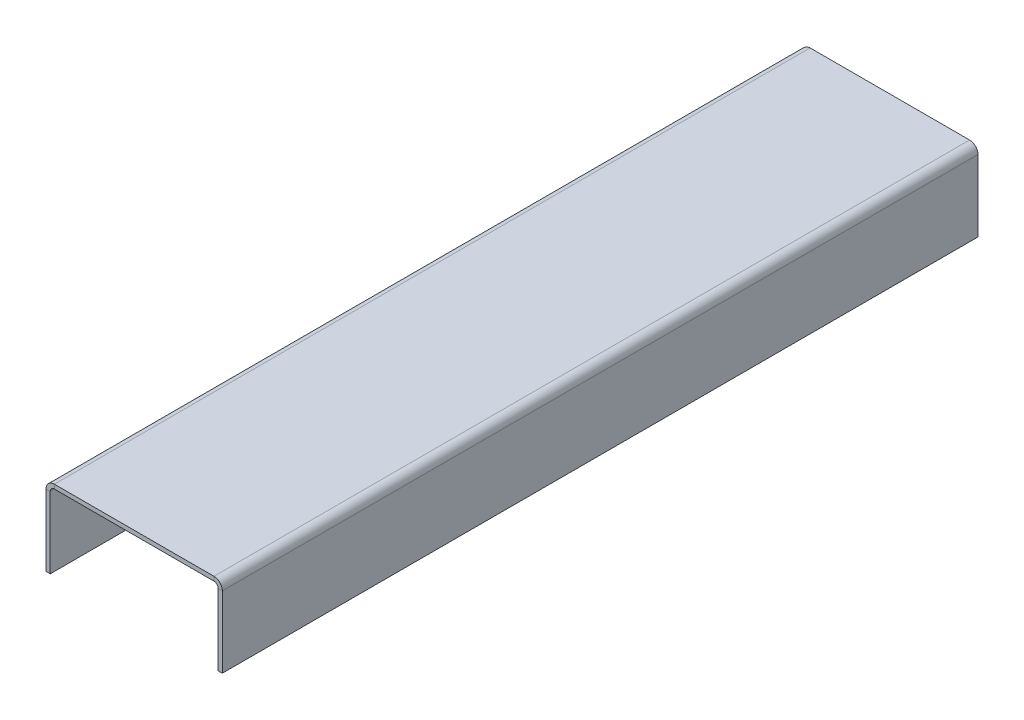
ISO-10303-21;
HEADER;
FILE_DESCRIPTION(('STEP AP214'),'2;1');
FILE_NAME('part.step','',(''),(''),'','','');
FILE_SCHEMA(('AUTOMOTIVE_DESIGN { 1 0 10303 214 1 1 1 1 }'));
ENDSEC;
DATA;
#1=APPLICATION_CONTEXT('core data for automotive mechanical design processes');
#2=APPLICATION_PROTOCOL_DEFINITION('international standard','automotive_design',2000,#1);
#3=PRODUCT_CONTEXT('',#1,'mechanical');
#4=PRODUCT('Part','Part','',(#3));
#5=PRODUCT_RELATED_PRODUCT_CATEGORY('part','',(#4));
#6=PRODUCT_DEFINITION_FORMATION('','',#4);
#7=PRODUCT_DEFINITION_CONTEXT('part definition',#1,'design');
#8=PRODUCT_DEFINITION('design','',#6,#7);
#9=PRODUCT_DEFINITION_SHAPE('','',#8);
#10=(LENGTH_UNIT() NAMED_UNIT(*) SI_UNIT(.MILLI.,.METRE.));
#11=(NAMED_UNIT(*) PLANE_ANGLE_UNIT() SI_UNIT($,.RADIAN.));
#12=(NAMED_UNIT(*) SI_UNIT($,.STERADIAN.) SOLID_ANGLE_UNIT());
#13=UNCERTAINTY_MEASURE_WITH_UNIT(LENGTH_MEASURE(1.E-05),#10,'distance_accuracy_value','');
#14=(GEOMETRIC_REPRESENTATION_CONTEXT(3) GLOBAL_UNCERTAINTY_ASSIGNED_CONTEXT((#13)) GLOBAL_UNIT_ASSIGNED_CONTEXT((#10,
#11,#12)) REPRESENTATION_CONTEXT('',''));
#15=CARTESIAN_POINT('',(0.,0.,0.));
#16=DIRECTION('',(0.,0.,1.));
#17=DIRECTION('',(1.,0.,0.));
#18=AXIS2_PLACEMENT_3D('',#15,#16,#17);
#19=CARTESIAN_POINT('',(-40.,242.,-180.));
#20=DIRECTION('',(0.,0.,1.));
#21=DIRECTION('',(1.,0.,0.));
#22=AXIS2_PLACEMENT_3D('',#19,#20,#21);
#23=PLANE('',#22);
#24=DIRECTION('',(0.,1.,0.));
#25=VECTOR('',#24,1.);
#26=CARTESIAN_POINT('',(-38.,240.,-180.));
#27=LINE('',#26,#25);
#28=CARTESIAN_POINT('',(-38.,240.,-180.));
#29=VERTEX_POINT('',#28);
#30=CARTESIAN_POINT('',(-38.,242.,-180.));
#31=VERTEX_POINT('',#30);
#32=EDGE_CURVE('E203',#29,#31,#27,.T.);
#33=ORIENTED_EDGE('',*,*,#32,.T.);
#34=DIRECTION('',(-1.,0.,0.));
#35=VECTOR('',#34,1.);
#36=CARTESIAN_POINT('',(-40.,242.,-180.));
#37=LINE('',#36,#35);
#38=CARTESIAN_POINT('',(38.,242.,-180.));
#39=VERTEX_POINT('',#38);
#40=EDGE_CURVE('E58',#39,#31,#37,.T.);
#41=ORIENTED_EDGE('',*,*,#40,.F.);
#42=DIRECTION('',(0.,1.,0.));
#43=VECTOR('',#42,1.);
#44=CARTESIAN_POINT('',(38.,240.,-180.));
#45=LINE('',#44,#43);
#46=CARTESIAN_POINT('',(38.,240.,-180.));
#47=VERTEX_POINT('',#46);
#48=EDGE_CURVE('E282',#47,#39,#45,.T.);
#49=ORIENTED_EDGE('',*,*,#48,.F.);
#50=DIRECTION('',(-1.,0.,0.));
#51=VECTOR('',#50,1.);
#52=CARTESIAN_POINT('',(-40.,240.,-180.));
#53=LINE('',#52,#51);
#54=EDGE_CURVE('E285',#47,#29,#53,.T.);
#55=ORIENTED_EDGE('',*,*,#54,.T.);
#56=EDGE_LOOP('',(#33,#41,#49,#55));
#57=FACE_BOUND('',#56,.T.);
#58=ADVANCED_FACE('F49',(#57),#23,.F.);
#59=CARTESIAN_POINT('',(-40.,242.,180.));
#60=DIRECTION('',(0.,0.,-1.));
#61=DIRECTION('',(-1.,0.,0.));
#62=AXIS2_PLACEMENT_3D('',#59,#60,#61);
#63=PLANE('',#62);
#64=DIRECTION('',(0.,1.,0.));
#65=VECTOR('',#64,1.);
#66=CARTESIAN_POINT('',(-38.,240.,180.));
#67=LINE('',#66,#65);
#68=CARTESIAN_POINT('',(-38.,240.,180.));
#69=VERTEX_POINT('',#68);
#70=CARTESIAN_POINT('',(-38.,242.,180.));
#71=VERTEX_POINT('',#70);
#72=EDGE_CURVE('E213',#69,#71,#67,.T.);
#73=ORIENTED_EDGE('',*,*,#72,.F.);
#74=DIRECTION('',(1.,0.,0.));
#75=VECTOR('',#74,1.);
#76=CARTESIAN_POINT('',(-40.,240.,180.));
#77=LINE('',#76,#75);
#78=CARTESIAN_POINT('',(38.,240.,180.));
#79=VERTEX_POINT('',#78);
#80=EDGE_CURVE('E52',#69,#79,#77,.T.);
#81=ORIENTED_EDGE('',*,*,#80,.T.);
#82=DIRECTION('',(0.,1.,0.));
#83=VECTOR('',#82,1.);
#84=CARTESIAN_POINT('',(38.,240.,180.));
#85=LINE('',#84,#83);
#86=CARTESIAN_POINT('',(38.,242.,180.));
#87=VERTEX_POINT('',#86);
#88=EDGE_CURVE('E268',#79,#87,#85,.T.);
#89=ORIENTED_EDGE('',*,*,#88,.T.);
#90=DIRECTION('',(1.,0.,0.));
#91=VECTOR('',#90,1.);
#92=CARTESIAN_POINT('',(-40.,242.,180.));
#93=LINE('',#92,#91);
#94=EDGE_CURVE('E11',#71,#87,#93,.T.);
#95=ORIENTED_EDGE('',*,*,#94,.F.);
#96=EDGE_LOOP('',(#73,#81,#89,#95));
#97=FACE_BOUND('',#96,.T.);
#98=ADVANCED_FACE('F302',(#97),#63,.F.);
#99=CARTESIAN_POINT('',(0.,242.,0.));
#100=DIRECTION('',(0.,1.,0.));
#101=DIRECTION('',(0.,0.,1.));
#102=AXIS2_PLACEMENT_3D('',#99,#100,#101);
#103=PLANE('',#102);
#104=ORIENTED_EDGE('',*,*,#40,.T.);
#105=DIRECTION('',(0.,0.,-1.));
#106=VECTOR('',#105,1.);
#107=CARTESIAN_POINT('',(-38.,242.,-180.));
#108=LINE('',#107,#106);
#109=EDGE_CURVE('E144',#31,#71,#108,.F.);
#110=ORIENTED_EDGE('',*,*,#109,.T.);
#111=ORIENTED_EDGE('',*,*,#94,.T.);
#112=DIRECTION('',(0.,0.,1.));
#113=VECTOR('',#112,1.);
#114=CARTESIAN_POINT('',(38.,242.,180.));
#115=LINE('',#114,#113);
#116=EDGE_CURVE('E261',#87,#39,#115,.F.);
#117=ORIENTED_EDGE('',*,*,#116,.T.);
#118=EDGE_LOOP('',(#104,#110,#111,#117));
#119=FACE_BOUND('',#118,.T.);
#120=ADVANCED_FACE('F351',(#119),#103,.T.);
#121=CARTESIAN_POINT('',(0.,240.,0.));
#122=DIRECTION('',(0.,1.,0.));
#123=DIRECTION('',(0.,0.,1.));
#124=AXIS2_PLACEMENT_3D('',#121,#122,#123);
#125=PLANE('',#124);
#126=DIRECTION('',(0.,0.,-1.));
#127=VECTOR('',#126,1.);
#128=CARTESIAN_POINT('',(-38.,240.,-180.));
#129=LINE('',#128,#127);
#130=EDGE_CURVE('E208',#29,#69,#129,.F.);
#131=ORIENTED_EDGE('',*,*,#130,.F.);
#132=ORIENTED_EDGE('',*,*,#54,.F.);
#133=DIRECTION('',(0.,0.,1.));
#134=VECTOR('',#133,1.);
#135=CARTESIAN_POINT('',(38.,240.,180.));
#136=LINE('',#135,#134);
#137=EDGE_CURVE('E276',#79,#47,#136,.F.);
#138=ORIENTED_EDGE('',*,*,#137,.F.);
#139=ORIENTED_EDGE('',*,*,#80,.F.);
#140=EDGE_LOOP('',(#131,#132,#138,#139));
#141=FACE_BOUND('',#140,.T.);
#142=ADVANCED_FACE('F306',(#141),#125,.F.);
#143=CARTESIAN_POINT('',(38.,238.,-180.));
#144=DIRECTION('',(0.,0.,-1.));
#145=DIRECTION('',(-1.,0.,0.));
#146=AXIS2_PLACEMENT_3D('',#143,#144,#145);
#147=PLANE('',#146);
#148=DIRECTION('',(1.,0.,0.));
#149=VECTOR('',#148,1.);
#150=CARTESIAN_POINT('',(40.,238.,-180.));
#151=LINE('',#150,#149);
#152=CARTESIAN_POINT('',(40.,238.,-180.));
#153=VERTEX_POINT('',#152);
#154=CARTESIAN_POINT('',(42.,238.,-180.));
#155=VERTEX_POINT('',#154);
#156=EDGE_CURVE('E216',#153,#155,#151,.T.);
#157=ORIENTED_EDGE('',*,*,#156,.F.);
#158=CARTESIAN_POINT('',(38.,238.,-180.));
#159=DIRECTION('',(0.,0.,1.));
#160=DIRECTION('',(1.,0.,0.));
#161=AXIS2_PLACEMENT_3D('',#158,#159,#160);
#162=CIRCLE('',#161,2.00000000000002);
#163=EDGE_CURVE('E272',#47,#153,#162,.F.);
#164=ORIENTED_EDGE('',*,*,#163,.F.);
#165=ORIENTED_EDGE('',*,*,#48,.T.);
#166=CARTESIAN_POINT('',(38.,238.,-180.));
#167=DIRECTION('',(0.,0.,1.));
#168=DIRECTION('',(1.,0.,0.));
#169=AXIS2_PLACEMENT_3D('',#166,#167,#168);
#170=CIRCLE('',#169,4.00000000000002);
#171=EDGE_CURVE('E74',#39,#155,#170,.F.);
#172=ORIENTED_EDGE('',*,*,#171,.T.);
#173=EDGE_LOOP('',(#157,#164,#165,#172));
#174=FACE_BOUND('',#173,.T.);
#175=ADVANCED_FACE('F313',(#174),#147,.T.);
#176=CARTESIAN_POINT('',(38.,238.,180.));
#177=DIRECTION('',(0.,0.,-1.));
#178=DIRECTION('',(-1.,0.,0.));
#179=AXIS2_PLACEMENT_3D('',#176,#177,#178);
#180=PLANE('',#179);
#181=CARTESIAN_POINT('',(38.,238.,180.));
#182=DIRECTION('',(0.,0.,1.));
#183=DIRECTION('',(1.,0.,0.));
#184=AXIS2_PLACEMENT_3D('',#181,#182,#183);
#185=CIRCLE('',#184,2.00000000000002);
#186=CARTESIAN_POINT('',(40.,238.,180.));
#187=VERTEX_POINT('',#186);
#188=EDGE_CURVE('E260',#187,#79,#185,.T.);
#189=ORIENTED_EDGE('',*,*,#188,.F.);
#190=DIRECTION('',(1.,0.,0.));
#191=VECTOR('',#190,1.);
#192=CARTESIAN_POINT('',(40.,238.,180.));
#193=LINE('',#192,#191);
#194=CARTESIAN_POINT('',(42.,238.,180.));
#195=VERTEX_POINT('',#194);
#196=EDGE_CURVE('E222',#187,#195,#193,.T.);
#197=ORIENTED_EDGE('',*,*,#196,.T.);
#198=CARTESIAN_POINT('',(38.,238.,180.));
#199=DIRECTION('',(0.,0.,1.));
#200=DIRECTION('',(1.,0.,0.));
#201=AXIS2_PLACEMENT_3D('',#198,#199,#200);
#202=CIRCLE('',#201,4.00000000000002);
#203=EDGE_CURVE('E265',#195,#87,#202,.T.);
#204=ORIENTED_EDGE('',*,*,#203,.T.);
#205=ORIENTED_EDGE('',*,*,#88,.F.);
#206=EDGE_LOOP('',(#189,#197,#204,#205));
#207=FACE_BOUND('',#206,.T.);
#208=ADVANCED_FACE('F333',(#207),#180,.F.);
#209=CARTESIAN_POINT('',(38.,238.,180.));
#210=DIRECTION('',(0.,0.,1.));
#211=DIRECTION('',(1.,0.,0.));
#212=AXIS2_PLACEMENT_3D('',#209,#210,#211);
#213=CYLINDRICAL_SURFACE('',#212,4.00000000000002);
#214=ORIENTED_EDGE('',*,*,#116,.F.);
#215=ORIENTED_EDGE('',*,*,#203,.F.);
#216=DIRECTION('',(0.,0.,-1.));
#217=VECTOR('',#216,1.);
#218=CARTESIAN_POINT('',(42.,238.,0.));
#219=LINE('',#218,#217);
#220=EDGE_CURVE('E226',#195,#155,#219,.T.);
#221=ORIENTED_EDGE('',*,*,#220,.T.);
#222=ORIENTED_EDGE('',*,*,#171,.F.);
#223=EDGE_LOOP('',(#214,#215,#221,#222));
#224=FACE_BOUND('',#223,.T.);
#225=ADVANCED_FACE('F343',(#224),#213,.T.);
#226=CARTESIAN_POINT('',(38.,238.,180.));
#227=DIRECTION('',(0.,0.,1.));
#228=DIRECTION('',(1.,0.,0.));
#229=AXIS2_PLACEMENT_3D('',#226,#227,#228);
#230=CYLINDRICAL_SURFACE('',#229,2.00000000000002);
#231=ORIENTED_EDGE('',*,*,#137,.T.);
#232=ORIENTED_EDGE('',*,*,#163,.T.);
#233=DIRECTION('',(0.,0.,1.));
#234=VECTOR('',#233,1.);
#235=CARTESIAN_POINT('',(40.,238.,-180.));
#236=LINE('',#235,#234);
#237=EDGE_CURVE('E219',#153,#187,#236,.T.);
#238=ORIENTED_EDGE('',*,*,#237,.T.);
#239=ORIENTED_EDGE('',*,*,#188,.T.);
#240=EDGE_LOOP('',(#231,#232,#238,#239));
#241=FACE_BOUND('',#240,.T.);
#242=ADVANCED_FACE('F309',(#241),#230,.F.);
#243=CARTESIAN_POINT('',(42.0000000000001,204.,180.));
#244=DIRECTION('',(0.,0.,-1.));
#245=DIRECTION('',(-1.,0.,0.));
#246=AXIS2_PLACEMENT_3D('',#243,#244,#245);
#247=PLANE('',#246);
#248=ORIENTED_EDGE('',*,*,#196,.F.);
#249=DIRECTION('',(0.,-1.,0.));
#250=VECTOR('',#249,1.);
#251=CARTESIAN_POINT('',(40.0000000000001,204.,180.));
#252=LINE('',#251,#250);
#253=CARTESIAN_POINT('',(40.0000000000001,204.,180.));
#254=VERTEX_POINT('',#253);
#255=EDGE_CURVE('E232',#187,#254,#252,.T.);
#256=ORIENTED_EDGE('',*,*,#255,.T.);
#257=DIRECTION('',(-1.,0.,0.));
#258=VECTOR('',#257,1.);
#259=CARTESIAN_POINT('',(42.0000000000001,204.,180.));
#260=LINE('',#259,#258);
#261=CARTESIAN_POINT('',(42.0000000000001,204.,180.));
#262=VERTEX_POINT('',#261);
#263=EDGE_CURVE('E256',#262,#254,#260,.T.);
#264=ORIENTED_EDGE('',*,*,#263,.F.);
#265=DIRECTION('',(0.,-1.,0.));
#266=VECTOR('',#265,1.);
#267=CARTESIAN_POINT('',(42.0000000000001,204.,180.));
#268=LINE('',#267,#266);
#269=EDGE_CURVE('E233',#195,#262,#268,.T.);
#270=ORIENTED_EDGE('',*,*,#269,.F.);
#271=EDGE_LOOP('',(#248,#256,#264,#270));
#272=FACE_BOUND('',#271,.T.);
#273=ADVANCED_FACE('F335',(#272),#247,.F.);
#274=CARTESIAN_POINT('',(42.,240.,-180.));
#275=DIRECTION('',(0.,0.,1.));
#276=DIRECTION('',(1.,0.,0.));
#277=AXIS2_PLACEMENT_3D('',#274,#275,#276);
#278=PLANE('',#277);
#279=ORIENTED_EDGE('',*,*,#156,.T.);
#280=DIRECTION('',(0.,1.,0.));
#281=VECTOR('',#280,1.);
#282=CARTESIAN_POINT('',(42.,240.,-180.));
#283=LINE('',#282,#281);
#284=CARTESIAN_POINT('',(42.0000000000001,204.,-180.));
#285=VERTEX_POINT('',#284);
#286=EDGE_CURVE('E240',#285,#155,#283,.T.);
#287=ORIENTED_EDGE('',*,*,#286,.F.);
#288=DIRECTION('',(-1.,0.,0.));
#289=VECTOR('',#288,1.);
#290=CARTESIAN_POINT('',(42.0000000000001,204.,-180.));
#291=LINE('',#290,#289);
#292=CARTESIAN_POINT('',(40.0000000000001,204.,-180.));
#293=VERTEX_POINT('',#292);
#294=EDGE_CURVE('E244',#285,#293,#291,.T.);
#295=ORIENTED_EDGE('',*,*,#294,.T.);
#296=DIRECTION('',(0.,1.,0.));
#297=VECTOR('',#296,1.);
#298=CARTESIAN_POINT('',(40.,240.,-180.));
#299=LINE('',#298,#297);
#300=EDGE_CURVE('E237',#293,#153,#299,.T.);
#301=ORIENTED_EDGE('',*,*,#300,.T.);
#302=EDGE_LOOP('',(#279,#287,#295,#301));
#303=FACE_BOUND('',#302,.T.);
#304=ADVANCED_FACE('F316',(#303),#278,.F.);
#305=CARTESIAN_POINT('',(42.0000000000008,1.45760840755834E-13,0.));
#306=DIRECTION('',(-1.,0.,0.));
#307=DIRECTION('',(0.,-1.,0.));
#308=AXIS2_PLACEMENT_3D('',#305,#306,#307);
#309=PLANE('',#308);
#310=ORIENTED_EDGE('',*,*,#220,.F.);
#311=ORIENTED_EDGE('',*,*,#269,.T.);
#312=DIRECTION('',(0.,0.,-1.));
#313=VECTOR('',#312,1.);
#314=CARTESIAN_POINT('',(42.0000000000001,204.,-180.));
#315=LINE('',#314,#313);
#316=EDGE_CURVE('E236',#262,#285,#315,.T.);
#317=ORIENTED_EDGE('',*,*,#316,.T.);
#318=ORIENTED_EDGE('',*,*,#286,.T.);
#319=EDGE_LOOP('',(#310,#311,#317,#318));
#320=FACE_BOUND('',#319,.T.);
#321=ADVANCED_FACE('F320',(#320),#309,.F.);
#322=CARTESIAN_POINT('',(40.0000000000008,1.38777878078147E-13,0.));
#323=DIRECTION('',(-1.,0.,0.));
#324=DIRECTION('',(0.,-1.,0.));
#325=AXIS2_PLACEMENT_3D('',#322,#323,#324);
#326=PLANE('',#325);
#327=ORIENTED_EDGE('',*,*,#255,.F.);
#328=ORIENTED_EDGE('',*,*,#237,.F.);
#329=ORIENTED_EDGE('',*,*,#300,.F.);
#330=DIRECTION('',(0.,0.,-1.));
#331=VECTOR('',#330,1.);
#332=CARTESIAN_POINT('',(40.0000000000001,204.,-180.));
#333=LINE('',#332,#331);
#334=EDGE_CURVE('E247',#254,#293,#333,.T.);
#335=ORIENTED_EDGE('',*,*,#334,.F.);
#336=EDGE_LOOP('',(#327,#328,#329,#335));
#337=FACE_BOUND('',#336,.T.);
#338=ADVANCED_FACE('F330',(#337),#326,.T.);
#339=CARTESIAN_POINT('',(42.0000000000001,204.,-180.));
#340=DIRECTION('',(0.,1.,0.));
#341=DIRECTION('',(-1.,0.,0.));
#342=AXIS2_PLACEMENT_3D('',#339,#340,#341);
#343=PLANE('',#342);
#344=ORIENTED_EDGE('',*,*,#334,.T.);
#345=ORIENTED_EDGE('',*,*,#294,.F.);
#346=ORIENTED_EDGE('',*,*,#316,.F.);
#347=ORIENTED_EDGE('',*,*,#263,.T.);
#348=EDGE_LOOP('',(#344,#345,#346,#347));
#349=FACE_BOUND('',#348,.T.);
#350=ADVANCED_FACE('F326',(#349),#343,.F.);
#351=CARTESIAN_POINT('',(-38.,238.,180.));
#352=DIRECTION('',(0.,0.,1.));
#353=DIRECTION('',(1.,0.,0.));
#354=AXIS2_PLACEMENT_3D('',#351,#352,#353);
#355=PLANE('',#354);
#356=DIRECTION('',(-1.,0.,0.));
#357=VECTOR('',#356,1.);
#358=CARTESIAN_POINT('',(-40.,238.,180.));
#359=LINE('',#358,#357);
#360=CARTESIAN_POINT('',(-40.,238.,180.));
#361=VERTEX_POINT('',#360);
#362=CARTESIAN_POINT('',(-42.,238.,180.));
#363=VERTEX_POINT('',#362);
#364=EDGE_CURVE('E574',#361,#363,#359,.T.);
#365=ORIENTED_EDGE('',*,*,#364,.F.);
#366=CARTESIAN_POINT('',(-38.,238.,180.));
#367=DIRECTION('',(0.,0.,-1.));
#368=DIRECTION('',(-1.,0.,0.));
#369=AXIS2_PLACEMENT_3D('',#366,#367,#368);
#370=CIRCLE('',#369,2.00000000000001);
#371=EDGE_CURVE('E148',#69,#361,#370,.F.);
#372=ORIENTED_EDGE('',*,*,#371,.F.);
#373=ORIENTED_EDGE('',*,*,#72,.T.);
#374=CARTESIAN_POINT('',(-38.,238.,180.));
#375=DIRECTION('',(0.,0.,-1.));
#376=DIRECTION('',(-1.,0.,0.));
#377=AXIS2_PLACEMENT_3D('',#374,#375,#376);
#378=CIRCLE('',#377,4.00000000000001);
#379=EDGE_CURVE('E66',#71,#363,#378,.F.);
#380=ORIENTED_EDGE('',*,*,#379,.T.);
#381=EDGE_LOOP('',(#365,#372,#373,#380));
#382=FACE_BOUND('',#381,.T.);
#383=ADVANCED_FACE('F432',(#382),#355,.T.);
#384=CARTESIAN_POINT('',(-38.,238.,-180.));
#385=DIRECTION('',(0.,0.,1.));
#386=DIRECTION('',(1.,0.,0.));
#387=AXIS2_PLACEMENT_3D('',#384,#385,#386);
#388=PLANE('',#387);
#389=CARTESIAN_POINT('',(-38.,238.,-180.));
#390=DIRECTION('',(0.,0.,-1.));
#391=DIRECTION('',(-1.,0.,0.));
#392=AXIS2_PLACEMENT_3D('',#389,#390,#391);
#393=CIRCLE('',#392,2.00000000000001);
#394=CARTESIAN_POINT('',(-40.,238.,-180.));
#395=VERTEX_POINT('',#394);
#396=EDGE_CURVE('E155',#395,#29,#393,.T.);
#397=ORIENTED_EDGE('',*,*,#396,.F.);
#398=DIRECTION('',(-1.,0.,0.));
#399=VECTOR('',#398,1.);
#400=CARTESIAN_POINT('',(-40.,238.,-180.));
#401=LINE('',#400,#399);
#402=CARTESIAN_POINT('',(-42.,238.,-180.));
#403=VERTEX_POINT('',#402);
#404=EDGE_CURVE('E152',#395,#403,#401,.T.);
#405=ORIENTED_EDGE('',*,*,#404,.T.);
#406=CARTESIAN_POINT('',(-38.,238.,-180.));
#407=DIRECTION('',(0.,0.,-1.));
#408=DIRECTION('',(-1.,0.,0.));
#409=AXIS2_PLACEMENT_3D('',#406,#407,#408);
#410=CIRCLE('',#409,4.00000000000001);
#411=EDGE_CURVE('E138',#403,#31,#410,.T.);
#412=ORIENTED_EDGE('',*,*,#411,.T.);
#413=ORIENTED_EDGE('',*,*,#32,.F.);
#414=EDGE_LOOP('',(#397,#405,#412,#413));
#415=FACE_BOUND('',#414,.T.);
#416=ADVANCED_FACE('F153',(#415),#388,.F.);
#417=CARTESIAN_POINT('',(-38.,238.,-180.));
#418=DIRECTION('',(0.,0.,-1.));
#419=DIRECTION('',(-1.,0.,0.));
#420=AXIS2_PLACEMENT_3D('',#417,#418,#419);
#421=CYLINDRICAL_SURFACE('',#420,4.00000000000001);
#422=ORIENTED_EDGE('',*,*,#109,.F.);
#423=ORIENTED_EDGE('',*,*,#411,.F.);
#424=DIRECTION('',(0.,0.,1.));
#425=VECTOR('',#424,1.);
#426=CARTESIAN_POINT('',(-42.,238.,0.));
#427=LINE('',#426,#425);
#428=EDGE_CURVE('E142',#403,#363,#427,.T.);
#429=ORIENTED_EDGE('',*,*,#428,.T.);
#430=ORIENTED_EDGE('',*,*,#379,.F.);
#431=EDGE_LOOP('',(#422,#423,#429,#430));
#432=FACE_BOUND('',#431,.T.);
#433=ADVANCED_FACE('F140',(#432),#421,.T.);
#434=CARTESIAN_POINT('',(-38.,238.,-180.));
#435=DIRECTION('',(0.,0.,-1.));
#436=DIRECTION('',(-1.,0.,0.));
#437=AXIS2_PLACEMENT_3D('',#434,#435,#436);
#438=CYLINDRICAL_SURFACE('',#437,2.00000000000001);
#439=ORIENTED_EDGE('',*,*,#130,.T.);
#440=ORIENTED_EDGE('',*,*,#371,.T.);
#441=DIRECTION('',(0.,0.,-1.));
#442=VECTOR('',#441,1.);
#443=CARTESIAN_POINT('',(-40.,238.,180.));
#444=LINE('',#443,#442);
#445=EDGE_CURVE('E160',#361,#395,#444,.T.);
#446=ORIENTED_EDGE('',*,*,#445,.T.);
#447=ORIENTED_EDGE('',*,*,#396,.T.);
#448=EDGE_LOOP('',(#439,#440,#446,#447));
#449=FACE_BOUND('',#448,.T.);
#450=ADVANCED_FACE('F460',(#449),#438,.F.);
#451=CARTESIAN_POINT('',(-42.0000000000001,204.,-180.));
#452=DIRECTION('',(0.,0.,1.));
#453=DIRECTION('',(1.,0.,0.));
#454=AXIS2_PLACEMENT_3D('',#451,#452,#453);
#455=PLANE('',#454);
#456=ORIENTED_EDGE('',*,*,#404,.F.);
#457=DIRECTION('',(0.,-1.,0.));
#458=VECTOR('',#457,1.);
#459=CARTESIAN_POINT('',(-40.0000000000001,204.,-180.));
#460=LINE('',#459,#458);
#461=CARTESIAN_POINT('',(-40.0000000000001,204.,-180.));
#462=VERTEX_POINT('',#461);
#463=EDGE_CURVE('E170',#395,#462,#460,.T.);
#464=ORIENTED_EDGE('',*,*,#463,.T.);
#465=DIRECTION('',(1.,0.,0.));
#466=VECTOR('',#465,1.);
#467=CARTESIAN_POINT('',(-42.0000000000001,204.,-180.));
#468=LINE('',#467,#466);
#469=CARTESIAN_POINT('',(-42.0000000000001,204.,-180.));
#470=VERTEX_POINT('',#469);
#471=EDGE_CURVE('E174',#470,#462,#468,.T.);
#472=ORIENTED_EDGE('',*,*,#471,.F.);
#473=DIRECTION('',(0.,-1.,0.));
#474=VECTOR('',#473,1.);
#475=CARTESIAN_POINT('',(-42.0000000000001,204.,-180.));
#476=LINE('',#475,#474);
#477=EDGE_CURVE('E165',#403,#470,#476,.T.);
#478=ORIENTED_EDGE('',*,*,#477,.F.);
#479=EDGE_LOOP('',(#456,#464,#472,#478));
#480=FACE_BOUND('',#479,.T.);
#481=ADVANCED_FACE('F172',(#480),#455,.F.);
#482=CARTESIAN_POINT('',(-42.,240.,180.));
#483=DIRECTION('',(0.,0.,-1.));
#484=DIRECTION('',(-1.,0.,0.));
#485=AXIS2_PLACEMENT_3D('',#482,#483,#484);
#486=PLANE('',#485);
#487=ORIENTED_EDGE('',*,*,#364,.T.);
#488=DIRECTION('',(0.,1.,0.));
#489=VECTOR('',#488,1.);
#490=CARTESIAN_POINT('',(-42.,240.,180.));
#491=LINE('',#490,#489);
#492=CARTESIAN_POINT('',(-42.0000000000001,204.,180.));
#493=VERTEX_POINT('',#492);
#494=EDGE_CURVE('E168',#493,#363,#491,.T.);
#495=ORIENTED_EDGE('',*,*,#494,.F.);
#496=DIRECTION('',(1.,0.,0.));
#497=VECTOR('',#496,1.);
#498=CARTESIAN_POINT('',(-42.0000000000001,204.,180.));
#499=LINE('',#498,#497);
#500=CARTESIAN_POINT('',(-40.0000000000001,204.,180.));
#501=VERTEX_POINT('',#500);
#502=EDGE_CURVE('E190',#493,#501,#499,.T.);
#503=ORIENTED_EDGE('',*,*,#502,.T.);
#504=DIRECTION('',(0.,1.,0.));
#505=VECTOR('',#504,1.);
#506=CARTESIAN_POINT('',(-40.,240.,180.));
#507=LINE('',#506,#505);
#508=EDGE_CURVE('E178',#501,#361,#507,.T.);
#509=ORIENTED_EDGE('',*,*,#508,.T.);
#510=EDGE_LOOP('',(#487,#495,#503,#509));
#511=FACE_BOUND('',#510,.T.);
#512=ADVANCED_FACE('F480',(#511),#486,.F.);
#513=CARTESIAN_POINT('',(-42.0000000000008,1.45760840755834E-13,0.));
#514=DIRECTION('',(1.,0.,0.));
#515=DIRECTION('',(0.,1.,0.));
#516=AXIS2_PLACEMENT_3D('',#513,#514,#515);
#517=PLANE('',#516);
#518=ORIENTED_EDGE('',*,*,#428,.F.);
#519=ORIENTED_EDGE('',*,*,#477,.T.);
#520=DIRECTION('',(0.,0.,1.));
#521=VECTOR('',#520,1.);
#522=CARTESIAN_POINT('',(-42.0000000000001,204.,180.));
#523=LINE('',#522,#521);
#524=EDGE_CURVE('E177',#470,#493,#523,.T.);
#525=ORIENTED_EDGE('',*,*,#524,.T.);
#526=ORIENTED_EDGE('',*,*,#494,.T.);
#527=EDGE_LOOP('',(#518,#519,#525,#526));
#528=FACE_BOUND('',#527,.T.);
#529=ADVANCED_FACE('F164',(#528),#517,.F.);
#530=CARTESIAN_POINT('',(-40.0000000000008,1.38777878078147E-13,0.));
#531=DIRECTION('',(1.,0.,0.));
#532=DIRECTION('',(0.,1.,0.));
#533=AXIS2_PLACEMENT_3D('',#530,#531,#532);
#534=PLANE('',#533);
#535=ORIENTED_EDGE('',*,*,#463,.F.);
#536=ORIENTED_EDGE('',*,*,#445,.F.);
#537=ORIENTED_EDGE('',*,*,#508,.F.);
#538=DIRECTION('',(0.,0.,1.));
#539=VECTOR('',#538,1.);
#540=CARTESIAN_POINT('',(-40.0000000000001,204.,180.));
#541=LINE('',#540,#539);
#542=EDGE_CURVE('E184',#462,#501,#541,.T.);
#543=ORIENTED_EDGE('',*,*,#542,.F.);
#544=EDGE_LOOP('',(#535,#536,#537,#543));
#545=FACE_BOUND('',#544,.T.);
#546=ADVANCED_FACE('F500',(#545),#534,.T.);
#547=CARTESIAN_POINT('',(-42.0000000000001,204.,180.));
#548=DIRECTION('',(0.,1.,0.));
#549=DIRECTION('',(-1.,0.,0.));
#550=AXIS2_PLACEMENT_3D('',#547,#548,#549);
#551=PLANE('',#550);
#552=ORIENTED_EDGE('',*,*,#542,.T.);
#553=ORIENTED_EDGE('',*,*,#502,.F.);
#554=ORIENTED_EDGE('',*,*,#524,.F.);
#555=ORIENTED_EDGE('',*,*,#471,.T.);
#556=EDGE_LOOP('',(#552,#553,#554,#555));
#557=FACE_BOUND('',#556,.T.);
#558=ADVANCED_FACE('F510',(#557),#551,.F.);
#559=CLOSED_SHELL('',(#58,#98,#120,#142,#175,#208,#225,#242,#273,#304,#321,#338,#350,#383,#416,
#433,#450,#481,#512,#529,#546,#558));
#560=MANIFOLD_SOLID_BREP('B2',#559);
#561=ADVANCED_BREP_SHAPE_REPRESENTATION('',(#18,#560),#14);
#562=SHAPE_DEFINITION_REPRESENTATION(#9,#561);
ENDSEC;
END-ISO-10303-21;
